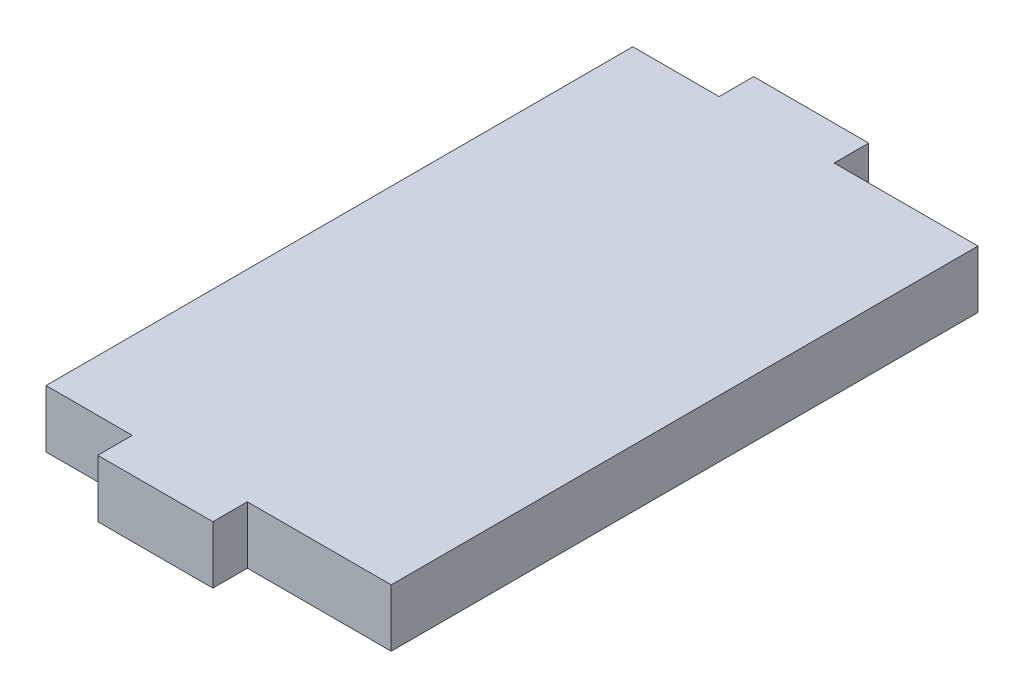
ISO-10303-21;
HEADER;
FILE_DESCRIPTION(('STEP AP214'),'2;1');
FILE_NAME('part.step','',(''),(''),'','','');
FILE_SCHEMA(('AUTOMOTIVE_DESIGN { 1 0 10303 214 1 1 1 1 }'));
ENDSEC;
DATA;
#1=APPLICATION_CONTEXT('core data for automotive mechanical design processes');
#2=APPLICATION_PROTOCOL_DEFINITION('international standard','automotive_design',2000,#1);
#3=PRODUCT_CONTEXT('',#1,'mechanical');
#4=PRODUCT('Part','Part','',(#3));
#5=PRODUCT_RELATED_PRODUCT_CATEGORY('part','',(#4));
#6=PRODUCT_DEFINITION_FORMATION('','',#4);
#7=PRODUCT_DEFINITION_CONTEXT('part definition',#1,'design');
#8=PRODUCT_DEFINITION('design','',#6,#7);
#9=PRODUCT_DEFINITION_SHAPE('','',#8);
#10=(LENGTH_UNIT() NAMED_UNIT(*) SI_UNIT(.MILLI.,.METRE.));
#11=(NAMED_UNIT(*) PLANE_ANGLE_UNIT() SI_UNIT($,.RADIAN.));
#12=(NAMED_UNIT(*) SI_UNIT($,.STERADIAN.) SOLID_ANGLE_UNIT());
#13=UNCERTAINTY_MEASURE_WITH_UNIT(LENGTH_MEASURE(1.E-05),#10,'distance_accuracy_value','');
#14=(GEOMETRIC_REPRESENTATION_CONTEXT(3) GLOBAL_UNCERTAINTY_ASSIGNED_CONTEXT((#13)) GLOBAL_UNIT_ASSIGNED_CONTEXT((#10,
#11,#12)) REPRESENTATION_CONTEXT('',''));
#15=CARTESIAN_POINT('',(0.,0.,0.));
#16=DIRECTION('',(0.,0.,1.));
#17=DIRECTION('',(1.,0.,0.));
#18=AXIS2_PLACEMENT_3D('',#15,#16,#17);
#19=CARTESIAN_POINT('',(15.,5.,25.5));
#20=DIRECTION('',(-1.,0.,0.));
#21=DIRECTION('',(0.,0.,1.));
#22=AXIS2_PLACEMENT_3D('',#19,#20,#21);
#23=PLANE('',#22);
#24=DIRECTION('',(0.,0.,-1.));
#25=VECTOR('',#24,1.);
#26=CARTESIAN_POINT('',(15.,0.,25.5));
#27=LINE('',#26,#25);
#28=CARTESIAN_POINT('',(15.,0.,25.5));
#29=VERTEX_POINT('',#28);
#30=CARTESIAN_POINT('',(15.,0.,-25.5));
#31=VERTEX_POINT('',#30);
#32=EDGE_CURVE('E155',#29,#31,#27,.T.);
#33=ORIENTED_EDGE('',*,*,#32,.T.);
#34=DIRECTION('',(0.,-1.,0.));
#35=VECTOR('',#34,1.);
#36=CARTESIAN_POINT('',(15.,5.,-25.5));
#37=LINE('',#36,#35);
#38=CARTESIAN_POINT('',(15.,5.,-25.5));
#39=VERTEX_POINT('',#38);
#40=EDGE_CURVE('E11',#39,#31,#37,.T.);
#41=ORIENTED_EDGE('',*,*,#40,.F.);
#42=DIRECTION('',(0.,0.,-1.));
#43=VECTOR('',#42,1.);
#44=CARTESIAN_POINT('',(15.,5.,25.5));
#45=LINE('',#44,#43);
#46=CARTESIAN_POINT('',(15.,5.,25.5));
#47=VERTEX_POINT('',#46);
#48=EDGE_CURVE('E177',#47,#39,#45,.T.);
#49=ORIENTED_EDGE('',*,*,#48,.F.);
#50=DIRECTION('',(0.,-1.,0.));
#51=VECTOR('',#50,1.);
#52=CARTESIAN_POINT('',(15.,5.,25.5));
#53=LINE('',#52,#51);
#54=EDGE_CURVE('E151',#47,#29,#53,.T.);
#55=ORIENTED_EDGE('',*,*,#54,.T.);
#56=EDGE_LOOP('',(#33,#41,#49,#55));
#57=FACE_BOUND('',#56,.T.);
#58=ADVANCED_FACE('F35',(#57),#23,.F.);
#59=CARTESIAN_POINT('',(15.,5.,-25.5));
#60=DIRECTION('',(0.,0.,1.));
#61=DIRECTION('',(1.,0.,0.));
#62=AXIS2_PLACEMENT_3D('',#59,#60,#61);
#63=PLANE('',#62);
#64=DIRECTION('',(-1.,0.,0.));
#65=VECTOR('',#64,1.);
#66=CARTESIAN_POINT('',(15.,0.,-25.5));
#67=LINE('',#66,#65);
#68=CARTESIAN_POINT('',(2.5,0.,-25.5));
#69=VERTEX_POINT('',#68);
#70=EDGE_CURVE('E158',#31,#69,#67,.T.);
#71=ORIENTED_EDGE('',*,*,#70,.T.);
#72=DIRECTION('',(0.,-1.,0.));
#73=VECTOR('',#72,1.);
#74=CARTESIAN_POINT('',(2.5,5.,-25.5));
#75=LINE('',#74,#73);
#76=CARTESIAN_POINT('',(2.5,5.,-25.5));
#77=VERTEX_POINT('',#76);
#78=EDGE_CURVE('E43',#77,#69,#75,.T.);
#79=ORIENTED_EDGE('',*,*,#78,.F.);
#80=DIRECTION('',(-1.,0.,0.));
#81=VECTOR('',#80,1.);
#82=CARTESIAN_POINT('',(15.,5.,-25.5));
#83=LINE('',#82,#81);
#84=EDGE_CURVE('E106',#39,#77,#83,.T.);
#85=ORIENTED_EDGE('',*,*,#84,.F.);
#86=ORIENTED_EDGE('',*,*,#40,.T.);
#87=EDGE_LOOP('',(#71,#79,#85,#86));
#88=FACE_BOUND('',#87,.T.);
#89=ADVANCED_FACE('F255',(#88),#63,.F.);
#90=CARTESIAN_POINT('',(2.5,5.,-25.5));
#91=DIRECTION('',(-1.,0.,0.));
#92=DIRECTION('',(0.,0.,1.));
#93=AXIS2_PLACEMENT_3D('',#90,#91,#92);
#94=PLANE('',#93);
#95=DIRECTION('',(0.,0.,-1.));
#96=VECTOR('',#95,1.);
#97=CARTESIAN_POINT('',(2.5,0.,-25.5));
#98=LINE('',#97,#96);
#99=CARTESIAN_POINT('',(2.5,0.,-28.5));
#100=VERTEX_POINT('',#99);
#101=EDGE_CURVE('E160',#69,#100,#98,.T.);
#102=ORIENTED_EDGE('',*,*,#101,.T.);
#103=DIRECTION('',(0.,-1.,0.));
#104=VECTOR('',#103,1.);
#105=CARTESIAN_POINT('',(2.5,5.,-28.5));
#106=LINE('',#105,#104);
#107=CARTESIAN_POINT('',(2.5,5.,-28.5));
#108=VERTEX_POINT('',#107);
#109=EDGE_CURVE('E196',#108,#100,#106,.T.);
#110=ORIENTED_EDGE('',*,*,#109,.F.);
#111=DIRECTION('',(0.,0.,-1.));
#112=VECTOR('',#111,1.);
#113=CARTESIAN_POINT('',(2.5,5.,-25.5));
#114=LINE('',#113,#112);
#115=EDGE_CURVE('E204',#77,#108,#114,.T.);
#116=ORIENTED_EDGE('',*,*,#115,.F.);
#117=ORIENTED_EDGE('',*,*,#78,.T.);
#118=EDGE_LOOP('',(#102,#110,#116,#117));
#119=FACE_BOUND('',#118,.T.);
#120=ADVANCED_FACE('F202',(#119),#94,.F.);
#121=CARTESIAN_POINT('',(2.5,5.,-28.5));
#122=DIRECTION('',(0.,0.,1.));
#123=DIRECTION('',(1.,0.,0.));
#124=AXIS2_PLACEMENT_3D('',#121,#122,#123);
#125=PLANE('',#124);
#126=DIRECTION('',(-1.,0.,0.));
#127=VECTOR('',#126,1.);
#128=CARTESIAN_POINT('',(2.5,0.,-28.5));
#129=LINE('',#128,#127);
#130=CARTESIAN_POINT('',(-7.50000000000001,0.,-28.5));
#131=VERTEX_POINT('',#130);
#132=EDGE_CURVE('E162',#100,#131,#129,.T.);
#133=ORIENTED_EDGE('',*,*,#132,.T.);
#134=DIRECTION('',(0.,-1.,0.));
#135=VECTOR('',#134,1.);
#136=CARTESIAN_POINT('',(-7.50000000000001,5.,-28.5));
#137=LINE('',#136,#135);
#138=CARTESIAN_POINT('',(-7.50000000000001,5.,-28.5));
#139=VERTEX_POINT('',#138);
#140=EDGE_CURVE('E193',#139,#131,#137,.T.);
#141=ORIENTED_EDGE('',*,*,#140,.F.);
#142=DIRECTION('',(-1.,0.,0.));
#143=VECTOR('',#142,1.);
#144=CARTESIAN_POINT('',(2.5,5.,-28.5));
#145=LINE('',#144,#143);
#146=EDGE_CURVE('E222',#108,#139,#145,.T.);
#147=ORIENTED_EDGE('',*,*,#146,.F.);
#148=ORIENTED_EDGE('',*,*,#109,.T.);
#149=EDGE_LOOP('',(#133,#141,#147,#148));
#150=FACE_BOUND('',#149,.T.);
#151=ADVANCED_FACE('F213',(#150),#125,.F.);
#152=CARTESIAN_POINT('',(-7.50000000000001,5.,-28.5));
#153=DIRECTION('',(1.,0.,0.));
#154=DIRECTION('',(0.,0.,-1.));
#155=AXIS2_PLACEMENT_3D('',#152,#153,#154);
#156=PLANE('',#155);
#157=DIRECTION('',(0.,0.,1.));
#158=VECTOR('',#157,1.);
#159=CARTESIAN_POINT('',(-7.50000000000001,0.,-28.5));
#160=LINE('',#159,#158);
#161=CARTESIAN_POINT('',(-7.50000000000001,0.,-25.5));
#162=VERTEX_POINT('',#161);
#163=EDGE_CURVE('E164',#131,#162,#160,.T.);
#164=ORIENTED_EDGE('',*,*,#163,.T.);
#165=DIRECTION('',(0.,-1.,0.));
#166=VECTOR('',#165,1.);
#167=CARTESIAN_POINT('',(-7.50000000000001,5.,-25.5));
#168=LINE('',#167,#166);
#169=CARTESIAN_POINT('',(-7.50000000000001,5.,-25.5));
#170=VERTEX_POINT('',#169);
#171=EDGE_CURVE('E190',#170,#162,#168,.T.);
#172=ORIENTED_EDGE('',*,*,#171,.F.);
#173=DIRECTION('',(0.,0.,1.));
#174=VECTOR('',#173,1.);
#175=CARTESIAN_POINT('',(-7.50000000000001,5.,-28.5));
#176=LINE('',#175,#174);
#177=EDGE_CURVE('E219',#139,#170,#176,.T.);
#178=ORIENTED_EDGE('',*,*,#177,.F.);
#179=ORIENTED_EDGE('',*,*,#140,.T.);
#180=EDGE_LOOP('',(#164,#172,#178,#179));
#181=FACE_BOUND('',#180,.T.);
#182=ADVANCED_FACE('F217',(#181),#156,.F.);
#183=CARTESIAN_POINT('',(-7.50000000000001,5.,-25.5));
#184=DIRECTION('',(0.,0.,1.));
#185=DIRECTION('',(1.,0.,0.));
#186=AXIS2_PLACEMENT_3D('',#183,#184,#185);
#187=PLANE('',#186);
#188=DIRECTION('',(-1.,0.,0.));
#189=VECTOR('',#188,1.);
#190=CARTESIAN_POINT('',(-7.50000000000001,0.,-25.5));
#191=LINE('',#190,#189);
#192=CARTESIAN_POINT('',(-15.,0.,-25.5));
#193=VERTEX_POINT('',#192);
#194=EDGE_CURVE('E166',#162,#193,#191,.T.);
#195=ORIENTED_EDGE('',*,*,#194,.T.);
#196=DIRECTION('',(0.,-1.,0.));
#197=VECTOR('',#196,1.);
#198=CARTESIAN_POINT('',(-15.,5.,-25.5));
#199=LINE('',#198,#197);
#200=CARTESIAN_POINT('',(-15.,5.,-25.5));
#201=VERTEX_POINT('',#200);
#202=EDGE_CURVE('E187',#201,#193,#199,.T.);
#203=ORIENTED_EDGE('',*,*,#202,.F.);
#204=DIRECTION('',(-1.,0.,0.));
#205=VECTOR('',#204,1.);
#206=CARTESIAN_POINT('',(-7.50000000000001,5.,-25.5));
#207=LINE('',#206,#205);
#208=EDGE_CURVE('E221',#170,#201,#207,.T.);
#209=ORIENTED_EDGE('',*,*,#208,.F.);
#210=ORIENTED_EDGE('',*,*,#171,.T.);
#211=EDGE_LOOP('',(#195,#203,#209,#210));
#212=FACE_BOUND('',#211,.T.);
#213=ADVANCED_FACE('F268',(#212),#187,.F.);
#214=CARTESIAN_POINT('',(-15.,5.,-25.5));
#215=DIRECTION('',(1.,0.,0.));
#216=DIRECTION('',(0.,0.,-1.));
#217=AXIS2_PLACEMENT_3D('',#214,#215,#216);
#218=PLANE('',#217);
#219=DIRECTION('',(0.,0.,1.));
#220=VECTOR('',#219,1.);
#221=CARTESIAN_POINT('',(-15.,0.,-25.5));
#222=LINE('',#221,#220);
#223=CARTESIAN_POINT('',(-15.,0.,25.5));
#224=VERTEX_POINT('',#223);
#225=EDGE_CURVE('E168',#193,#224,#222,.T.);
#226=ORIENTED_EDGE('',*,*,#225,.T.);
#227=DIRECTION('',(0.,-1.,0.));
#228=VECTOR('',#227,1.);
#229=CARTESIAN_POINT('',(-15.,5.,25.5));
#230=LINE('',#229,#228);
#231=CARTESIAN_POINT('',(-15.,5.,25.5));
#232=VERTEX_POINT('',#231);
#233=EDGE_CURVE('E184',#232,#224,#230,.T.);
#234=ORIENTED_EDGE('',*,*,#233,.F.);
#235=DIRECTION('',(0.,0.,1.));
#236=VECTOR('',#235,1.);
#237=CARTESIAN_POINT('',(-15.,5.,-25.5));
#238=LINE('',#237,#236);
#239=EDGE_CURVE('E224',#201,#232,#238,.T.);
#240=ORIENTED_EDGE('',*,*,#239,.F.);
#241=ORIENTED_EDGE('',*,*,#202,.T.);
#242=EDGE_LOOP('',(#226,#234,#240,#241));
#243=FACE_BOUND('',#242,.T.);
#244=ADVANCED_FACE('F271',(#243),#218,.F.);
#245=CARTESIAN_POINT('',(-15.,5.,25.5));
#246=DIRECTION('',(0.,0.,-1.));
#247=DIRECTION('',(-1.,0.,0.));
#248=AXIS2_PLACEMENT_3D('',#245,#246,#247);
#249=PLANE('',#248);
#250=DIRECTION('',(1.,0.,0.));
#251=VECTOR('',#250,1.);
#252=CARTESIAN_POINT('',(-15.,0.,25.5));
#253=LINE('',#252,#251);
#254=CARTESIAN_POINT('',(-7.5,0.,25.5));
#255=VERTEX_POINT('',#254);
#256=EDGE_CURVE('E170',#224,#255,#253,.T.);
#257=ORIENTED_EDGE('',*,*,#256,.T.);
#258=DIRECTION('',(0.,-1.,0.));
#259=VECTOR('',#258,1.);
#260=CARTESIAN_POINT('',(-7.5,5.,25.5));
#261=LINE('',#260,#259);
#262=CARTESIAN_POINT('',(-7.5,5.,25.5));
#263=VERTEX_POINT('',#262);
#264=EDGE_CURVE('E181',#263,#255,#261,.T.);
#265=ORIENTED_EDGE('',*,*,#264,.F.);
#266=DIRECTION('',(1.,0.,0.));
#267=VECTOR('',#266,1.);
#268=CARTESIAN_POINT('',(-15.,5.,25.5));
#269=LINE('',#268,#267);
#270=EDGE_CURVE('E230',#232,#263,#269,.T.);
#271=ORIENTED_EDGE('',*,*,#270,.F.);
#272=ORIENTED_EDGE('',*,*,#233,.T.);
#273=EDGE_LOOP('',(#257,#265,#271,#272));
#274=FACE_BOUND('',#273,.T.);
#275=ADVANCED_FACE('F236',(#274),#249,.F.);
#276=CARTESIAN_POINT('',(-7.5,5.,25.5));
#277=DIRECTION('',(1.,0.,0.));
#278=DIRECTION('',(0.,0.,-1.));
#279=AXIS2_PLACEMENT_3D('',#276,#277,#278);
#280=PLANE('',#279);
#281=DIRECTION('',(0.,0.,1.));
#282=VECTOR('',#281,1.);
#283=CARTESIAN_POINT('',(-7.5,0.,25.5));
#284=LINE('',#283,#282);
#285=CARTESIAN_POINT('',(-7.5,0.,28.5));
#286=VERTEX_POINT('',#285);
#287=EDGE_CURVE('E172',#255,#286,#284,.T.);
#288=ORIENTED_EDGE('',*,*,#287,.T.);
#289=DIRECTION('',(0.,-1.,0.));
#290=VECTOR('',#289,1.);
#291=CARTESIAN_POINT('',(-7.5,5.,28.5));
#292=LINE('',#291,#290);
#293=CARTESIAN_POINT('',(-7.5,5.,28.5));
#294=VERTEX_POINT('',#293);
#295=EDGE_CURVE('E146',#294,#286,#292,.T.);
#296=ORIENTED_EDGE('',*,*,#295,.F.);
#297=DIRECTION('',(0.,0.,1.));
#298=VECTOR('',#297,1.);
#299=CARTESIAN_POINT('',(-7.5,5.,25.5));
#300=LINE('',#299,#298);
#301=EDGE_CURVE('E137',#263,#294,#300,.T.);
#302=ORIENTED_EDGE('',*,*,#301,.F.);
#303=ORIENTED_EDGE('',*,*,#264,.T.);
#304=EDGE_LOOP('',(#288,#296,#302,#303));
#305=FACE_BOUND('',#304,.T.);
#306=ADVANCED_FACE('F240',(#305),#280,.F.);
#307=CARTESIAN_POINT('',(-7.5,5.,28.5));
#308=DIRECTION('',(0.,0.,-1.));
#309=DIRECTION('',(-1.,0.,0.));
#310=AXIS2_PLACEMENT_3D('',#307,#308,#309);
#311=PLANE('',#310);
#312=DIRECTION('',(1.,0.,0.));
#313=VECTOR('',#312,1.);
#314=CARTESIAN_POINT('',(-7.5,0.,28.5));
#315=LINE('',#314,#313);
#316=CARTESIAN_POINT('',(2.5,0.,28.5));
#317=VERTEX_POINT('',#316);
#318=EDGE_CURVE('E145',#286,#317,#315,.T.);
#319=ORIENTED_EDGE('',*,*,#318,.T.);
#320=DIRECTION('',(0.,-1.,0.));
#321=VECTOR('',#320,1.);
#322=CARTESIAN_POINT('',(2.5,5.,28.5));
#323=LINE('',#322,#321);
#324=CARTESIAN_POINT('',(2.5,5.,28.5));
#325=VERTEX_POINT('',#324);
#326=EDGE_CURVE('E142',#325,#317,#323,.T.);
#327=ORIENTED_EDGE('',*,*,#326,.F.);
#328=DIRECTION('',(1.,0.,0.));
#329=VECTOR('',#328,1.);
#330=CARTESIAN_POINT('',(-7.5,5.,28.5));
#331=LINE('',#330,#329);
#332=EDGE_CURVE('E131',#294,#325,#331,.T.);
#333=ORIENTED_EDGE('',*,*,#332,.F.);
#334=ORIENTED_EDGE('',*,*,#295,.T.);
#335=EDGE_LOOP('',(#319,#327,#333,#334));
#336=FACE_BOUND('',#335,.T.);
#337=ADVANCED_FACE('F143',(#336),#311,.F.);
#338=CARTESIAN_POINT('',(2.5,5.,28.5));
#339=DIRECTION('',(-1.,0.,0.));
#340=DIRECTION('',(0.,0.,1.));
#341=AXIS2_PLACEMENT_3D('',#338,#339,#340);
#342=PLANE('',#341);
#343=DIRECTION('',(0.,0.,-1.));
#344=VECTOR('',#343,1.);
#345=CARTESIAN_POINT('',(2.5,0.,28.5));
#346=LINE('',#345,#344);
#347=CARTESIAN_POINT('',(2.5,0.,25.5));
#348=VERTEX_POINT('',#347);
#349=EDGE_CURVE('E92',#317,#348,#346,.T.);
#350=ORIENTED_EDGE('',*,*,#349,.T.);
#351=DIRECTION('',(0.,-1.,0.));
#352=VECTOR('',#351,1.);
#353=CARTESIAN_POINT('',(2.5,5.,25.5));
#354=LINE('',#353,#352);
#355=CARTESIAN_POINT('',(2.5,5.,25.5));
#356=VERTEX_POINT('',#355);
#357=EDGE_CURVE('E147',#356,#348,#354,.T.);
#358=ORIENTED_EDGE('',*,*,#357,.F.);
#359=DIRECTION('',(0.,0.,-1.));
#360=VECTOR('',#359,1.);
#361=CARTESIAN_POINT('',(2.5,5.,28.5));
#362=LINE('',#361,#360);
#363=EDGE_CURVE('E135',#325,#356,#362,.T.);
#364=ORIENTED_EDGE('',*,*,#363,.F.);
#365=ORIENTED_EDGE('',*,*,#326,.T.);
#366=EDGE_LOOP('',(#350,#358,#364,#365));
#367=FACE_BOUND('',#366,.T.);
#368=ADVANCED_FACE('F149',(#367),#342,.F.);
#369=CARTESIAN_POINT('',(2.5,5.,25.5));
#370=DIRECTION('',(0.,0.,-1.));
#371=DIRECTION('',(-1.,0.,0.));
#372=AXIS2_PLACEMENT_3D('',#369,#370,#371);
#373=PLANE('',#372);
#374=DIRECTION('',(1.,0.,0.));
#375=VECTOR('',#374,1.);
#376=CARTESIAN_POINT('',(2.5,0.,25.5));
#377=LINE('',#376,#375);
#378=EDGE_CURVE('E98',#348,#29,#377,.T.);
#379=ORIENTED_EDGE('',*,*,#378,.T.);
#380=ORIENTED_EDGE('',*,*,#54,.F.);
#381=DIRECTION('',(1.,0.,0.));
#382=VECTOR('',#381,1.);
#383=CARTESIAN_POINT('',(2.5,5.,25.5));
#384=LINE('',#383,#382);
#385=EDGE_CURVE('E51',#356,#47,#384,.T.);
#386=ORIENTED_EDGE('',*,*,#385,.F.);
#387=ORIENTED_EDGE('',*,*,#357,.T.);
#388=EDGE_LOOP('',(#379,#380,#386,#387));
#389=FACE_BOUND('',#388,.T.);
#390=ADVANCED_FACE('F244',(#389),#373,.F.);
#391=CARTESIAN_POINT('',(0.,5.,0.));
#392=DIRECTION('',(0.,1.,0.));
#393=DIRECTION('',(0.,0.,1.));
#394=AXIS2_PLACEMENT_3D('',#391,#392,#393);
#395=PLANE('',#394);
#396=ORIENTED_EDGE('',*,*,#48,.T.);
#397=ORIENTED_EDGE('',*,*,#84,.T.);
#398=ORIENTED_EDGE('',*,*,#115,.T.);
#399=ORIENTED_EDGE('',*,*,#146,.T.);
#400=ORIENTED_EDGE('',*,*,#177,.T.);
#401=ORIENTED_EDGE('',*,*,#208,.T.);
#402=ORIENTED_EDGE('',*,*,#239,.T.);
#403=ORIENTED_EDGE('',*,*,#270,.T.);
#404=ORIENTED_EDGE('',*,*,#301,.T.);
#405=ORIENTED_EDGE('',*,*,#332,.T.);
#406=ORIENTED_EDGE('',*,*,#363,.T.);
#407=ORIENTED_EDGE('',*,*,#385,.T.);
#408=EDGE_LOOP('',(#396,#397,#398,#399,#400,#401,#402,#403,#404,#405,#406,#407));
#409=FACE_BOUND('',#408,.T.);
#410=ADVANCED_FACE('F133',(#409),#395,.T.);
#411=CARTESIAN_POINT('',(0.,0.,0.));
#412=DIRECTION('',(0.,1.,0.));
#413=DIRECTION('',(0.,0.,1.));
#414=AXIS2_PLACEMENT_3D('',#411,#412,#413);
#415=PLANE('',#414);
#416=ORIENTED_EDGE('',*,*,#32,.F.);
#417=ORIENTED_EDGE('',*,*,#378,.F.);
#418=ORIENTED_EDGE('',*,*,#349,.F.);
#419=ORIENTED_EDGE('',*,*,#318,.F.);
#420=ORIENTED_EDGE('',*,*,#287,.F.);
#421=ORIENTED_EDGE('',*,*,#256,.F.);
#422=ORIENTED_EDGE('',*,*,#225,.F.);
#423=ORIENTED_EDGE('',*,*,#194,.F.);
#424=ORIENTED_EDGE('',*,*,#163,.F.);
#425=ORIENTED_EDGE('',*,*,#132,.F.);
#426=ORIENTED_EDGE('',*,*,#101,.F.);
#427=ORIENTED_EDGE('',*,*,#70,.F.);
#428=EDGE_LOOP('',(#416,#417,#418,#419,#420,#421,#422,#423,#424,#425,#426,#427));
#429=FACE_BOUND('',#428,.T.);
#430=ADVANCED_FACE('F208',(#429),#415,.F.);
#431=CLOSED_SHELL('',(#58,#89,#120,#151,#182,#213,#244,#275,#306,#337,#368,#390,#410,#430));
#432=MANIFOLD_SOLID_BREP('B2',#431);
#433=ADVANCED_BREP_SHAPE_REPRESENTATION('',(#18,#432),#14);
#434=SHAPE_DEFINITION_REPRESENTATION(#9,#433);
ENDSEC;
END-ISO-10303-21;
